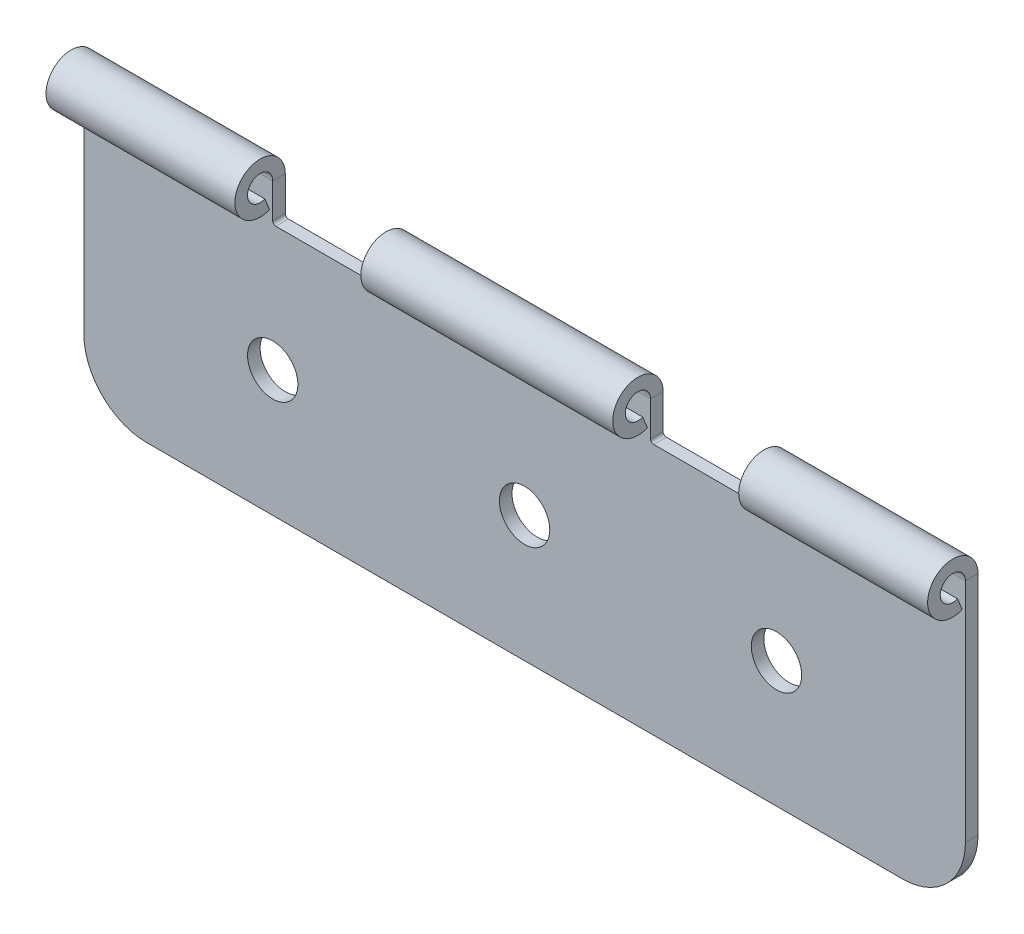
ISO-10303-21;
HEADER;
FILE_DESCRIPTION(('STEP AP214'),'2;1');
FILE_NAME('part.step','',(''),(''),'','','');
FILE_SCHEMA(('AUTOMOTIVE_DESIGN { 1 0 10303 214 1 1 1 1 }'));
ENDSEC;
DATA;
#1=APPLICATION_CONTEXT('core data for automotive mechanical design processes');
#2=APPLICATION_PROTOCOL_DEFINITION('international standard','automotive_design',2000,#1);
#3=PRODUCT_CONTEXT('',#1,'mechanical');
#4=PRODUCT('Part','Part','',(#3));
#5=PRODUCT_RELATED_PRODUCT_CATEGORY('part','',(#4));
#6=PRODUCT_DEFINITION_FORMATION('','',#4);
#7=PRODUCT_DEFINITION_CONTEXT('part definition',#1,'design');
#8=PRODUCT_DEFINITION('design','',#6,#7);
#9=PRODUCT_DEFINITION_SHAPE('','',#8);
#10=(LENGTH_UNIT() NAMED_UNIT(*) SI_UNIT(.MILLI.,.METRE.));
#11=(NAMED_UNIT(*) PLANE_ANGLE_UNIT() SI_UNIT($,.RADIAN.));
#12=(NAMED_UNIT(*) SI_UNIT($,.STERADIAN.) SOLID_ANGLE_UNIT());
#13=UNCERTAINTY_MEASURE_WITH_UNIT(LENGTH_MEASURE(1.E-05),#10,'distance_accuracy_value','');
#14=(GEOMETRIC_REPRESENTATION_CONTEXT(3) GLOBAL_UNCERTAINTY_ASSIGNED_CONTEXT((#13)) GLOBAL_UNIT_ASSIGNED_CONTEXT((#10,
#11,#12)) REPRESENTATION_CONTEXT('',''));
#15=CARTESIAN_POINT('',(0.,0.,0.));
#16=DIRECTION('',(0.,0.,1.));
#17=DIRECTION('',(1.,0.,0.));
#18=AXIS2_PLACEMENT_3D('',#15,#16,#17);
#19=CARTESIAN_POINT('',(135.,45.4282115593304,-4.44706117189366));
#20=DIRECTION('',(-1.,0.,0.));
#21=DIRECTION('',(0.,0.,1.));
#22=AXIS2_PLACEMENT_3D('',#19,#20,#21);
#23=PLANE('',#22);
#24=DIRECTION('',(0.,-1.,0.));
#25=VECTOR('',#24,1.);
#26=CARTESIAN_POINT('',(135.,45.4282115593304,-4.44706117189366));
#27=LINE('',#26,#25);
#28=CARTESIAN_POINT('',(135.,60.4282115593304,-4.44706117189367));
#29=VERTEX_POINT('',#28);
#30=CARTESIAN_POINT('',(135.,46.6782115593304,-4.44706117189366));
#31=VERTEX_POINT('',#30);
#32=EDGE_CURVE('E212',#29,#31,#27,.T.);
#33=ORIENTED_EDGE('',*,*,#32,.T.);
#34=DIRECTION('',(0.,0.,1.));
#35=VECTOR('',#34,1.);
#36=CARTESIAN_POINT('',(135.,46.6782115593304,0.552938828106335));
#37=LINE('',#36,#35);
#38=CARTESIAN_POINT('',(135.,46.6782115593304,0.552938828106335));
#39=VERTEX_POINT('',#38);
#40=EDGE_CURVE('E347',#31,#39,#37,.T.);
#41=ORIENTED_EDGE('',*,*,#40,.T.);
#42=DIRECTION('',(0.,-1.,0.));
#43=VECTOR('',#42,1.);
#44=CARTESIAN_POINT('',(135.,45.4282115593304,0.552938828106335));
#45=LINE('',#44,#43);
#46=CARTESIAN_POINT('',(135.,60.4282115593304,0.552938828106335));
#47=VERTEX_POINT('',#46);
#48=EDGE_CURVE('E352',#47,#39,#45,.T.);
#49=ORIENTED_EDGE('',*,*,#48,.F.);
#50=DIRECTION('',(0.,0.,-1.));
#51=VECTOR('',#50,1.);
#52=CARTESIAN_POINT('',(135.,60.4282115593304,0.552938828106327));
#53=LINE('',#52,#51);
#54=EDGE_CURVE('E224',#47,#29,#53,.T.);
#55=ORIENTED_EDGE('',*,*,#54,.T.);
#56=EDGE_LOOP('',(#33,#41,#49,#55));
#57=FACE_BOUND('',#56,.T.);
#58=ADVANCED_FACE('F44',(#57),#23,.T.);
#59=CARTESIAN_POINT('',(-15.,45.4282115593304,-4.44706117189366));
#60=DIRECTION('',(-1.,0.,0.));
#61=DIRECTION('',(0.,0.,1.));
#62=AXIS2_PLACEMENT_3D('',#59,#60,#61);
#63=PLANE('',#62);
#64=DIRECTION('',(0.,-1.,0.));
#65=VECTOR('',#64,1.);
#66=CARTESIAN_POINT('',(-15.,45.4282115593304,-4.44706117189366));
#67=LINE('',#66,#65);
#68=CARTESIAN_POINT('',(-15.,60.4282115593304,-4.44706117189368));
#69=VERTEX_POINT('',#68);
#70=CARTESIAN_POINT('',(-15.,46.6782115593304,-4.44706117189366));
#71=VERTEX_POINT('',#70);
#72=EDGE_CURVE('E337',#69,#71,#67,.T.);
#73=ORIENTED_EDGE('',*,*,#72,.T.);
#74=DIRECTION('',(0.,0.,1.));
#75=VECTOR('',#74,1.);
#76=CARTESIAN_POINT('',(-15.,46.6782115593304,0.552938828106335));
#77=LINE('',#76,#75);
#78=CARTESIAN_POINT('',(-15.,46.6782115593304,0.552938828106335));
#79=VERTEX_POINT('',#78);
#80=EDGE_CURVE('E379',#71,#79,#77,.T.);
#81=ORIENTED_EDGE('',*,*,#80,.T.);
#82=DIRECTION('',(0.,-1.,0.));
#83=VECTOR('',#82,1.);
#84=CARTESIAN_POINT('',(-15.,45.4282115593304,0.552938828106335));
#85=LINE('',#84,#83);
#86=CARTESIAN_POINT('',(-15.,60.4282115593304,0.552938828106335));
#87=VERTEX_POINT('',#86);
#88=EDGE_CURVE('E360',#87,#79,#85,.T.);
#89=ORIENTED_EDGE('',*,*,#88,.F.);
#90=DIRECTION('',(0.,0.,-1.));
#91=VECTOR('',#90,1.);
#92=CARTESIAN_POINT('',(-15.,60.4282115593304,0.552938828106324));
#93=LINE('',#92,#91);
#94=EDGE_CURVE('E269',#87,#69,#93,.T.);
#95=ORIENTED_EDGE('',*,*,#94,.T.);
#96=EDGE_LOOP('',(#73,#81,#89,#95));
#97=FACE_BOUND('',#96,.T.);
#98=ADVANCED_FACE('F462',(#97),#63,.T.);
#99=CARTESIAN_POINT('',(-140.,-54.5717884406696,-4.44706117189366));
#100=DIRECTION('',(-1.,0.,0.));
#101=DIRECTION('',(0.,0.,1.));
#102=AXIS2_PLACEMENT_3D('',#99,#100,#101);
#103=PLANE('',#102);
#104=DIRECTION('',(0.,-1.,0.));
#105=VECTOR('',#104,1.);
#106=CARTESIAN_POINT('',(-140.,-54.5717884406696,-4.44706117189366));
#107=LINE('',#106,#105);
#108=CARTESIAN_POINT('',(-140.,60.4282115593304,-4.44706117189367));
#109=VERTEX_POINT('',#108);
#110=CARTESIAN_POINT('',(-140.,-29.5717884406696,-4.44706117189366));
#111=VERTEX_POINT('',#110);
#112=EDGE_CURVE('E345',#109,#111,#107,.T.);
#113=ORIENTED_EDGE('',*,*,#112,.T.);
#114=DIRECTION('',(0.,0.,1.));
#115=VECTOR('',#114,1.);
#116=CARTESIAN_POINT('',(-140.,-29.5717884406696,-4.44706117189366));
#117=LINE('',#116,#115);
#118=CARTESIAN_POINT('',(-140.,-29.5717884406696,0.552938828106335));
#119=VERTEX_POINT('',#118);
#120=EDGE_CURVE('E11',#111,#119,#117,.T.);
#121=ORIENTED_EDGE('',*,*,#120,.T.);
#122=DIRECTION('',(0.,-1.,0.));
#123=VECTOR('',#122,1.);
#124=CARTESIAN_POINT('',(-140.,-54.5717884406696,0.552938828106335));
#125=LINE('',#124,#123);
#126=CARTESIAN_POINT('',(-140.,60.4282115593304,0.552938828106335));
#127=VERTEX_POINT('',#126);
#128=EDGE_CURVE('E329',#127,#119,#125,.T.);
#129=ORIENTED_EDGE('',*,*,#128,.F.);
#130=DIRECTION('',(0.,0.,-1.));
#131=VECTOR('',#130,1.);
#132=CARTESIAN_POINT('',(-140.,60.4282115593304,0.552938828106327));
#133=LINE('',#132,#131);
#134=EDGE_CURVE('E302',#127,#109,#133,.T.);
#135=ORIENTED_EDGE('',*,*,#134,.T.);
#136=EDGE_LOOP('',(#113,#121,#129,#135));
#137=FACE_BOUND('',#136,.T.);
#138=ADVANCED_FACE('F429',(#137),#103,.T.);
#139=CARTESIAN_POINT('',(210.,-54.5717884406696,-4.44706117189366));
#140=DIRECTION('',(0.,-1.,0.));
#141=DIRECTION('',(1.,0.,0.));
#142=AXIS2_PLACEMENT_3D('',#139,#140,#141);
#143=PLANE('',#142);
#144=DIRECTION('',(1.,0.,0.));
#145=VECTOR('',#144,1.);
#146=CARTESIAN_POINT('',(210.,-54.5717884406696,-4.44706117189366));
#147=LINE('',#146,#145);
#148=CARTESIAN_POINT('',(-115.,-54.5717884406696,-4.44706117189366));
#149=VERTEX_POINT('',#148);
#150=CARTESIAN_POINT('',(185.,-54.5717884406696,-4.44706117189366));
#151=VERTEX_POINT('',#150);
#152=EDGE_CURVE('E213',#149,#151,#147,.T.);
#153=ORIENTED_EDGE('',*,*,#152,.T.);
#154=DIRECTION('',(0.,0.,1.));
#155=VECTOR('',#154,1.);
#156=CARTESIAN_POINT('',(185.,-54.5717884406696,-4.44706117189366));
#157=LINE('',#156,#155);
#158=CARTESIAN_POINT('',(185.,-54.5717884406696,0.552938828106335));
#159=VERTEX_POINT('',#158);
#160=EDGE_CURVE('E407',#151,#159,#157,.T.);
#161=ORIENTED_EDGE('',*,*,#160,.T.);
#162=DIRECTION('',(1.,0.,0.));
#163=VECTOR('',#162,1.);
#164=CARTESIAN_POINT('',(210.,-54.5717884406696,0.552938828106335));
#165=LINE('',#164,#163);
#166=CARTESIAN_POINT('',(-115.,-54.5717884406696,0.552938828106335));
#167=VERTEX_POINT('',#166);
#168=EDGE_CURVE('E325',#167,#159,#165,.T.);
#169=ORIENTED_EDGE('',*,*,#168,.F.);
#170=DIRECTION('',(0.,0.,1.));
#171=VECTOR('',#170,1.);
#172=CARTESIAN_POINT('',(-115.,-54.5717884406696,-4.44706117189366));
#173=LINE('',#172,#171);
#174=EDGE_CURVE('E405',#167,#149,#173,.F.);
#175=ORIENTED_EDGE('',*,*,#174,.T.);
#176=EDGE_LOOP('',(#153,#161,#169,#175));
#177=FACE_BOUND('',#176,.T.);
#178=ADVANCED_FACE('F418',(#177),#143,.T.);
#179=CARTESIAN_POINT('',(-65.,70.4282115593304,-4.44706117189366));
#180=DIRECTION('',(1.,0.,0.));
#181=DIRECTION('',(0.,0.,-1.));
#182=AXIS2_PLACEMENT_3D('',#179,#180,#181);
#183=PLANE('',#182);
#184=DIRECTION('',(0.,1.,0.));
#185=VECTOR('',#184,1.);
#186=CARTESIAN_POINT('',(-65.,70.4282115593304,0.552938828106335));
#187=LINE('',#186,#185);
#188=CARTESIAN_POINT('',(-65.,46.6782115593304,0.552938828106335));
#189=VERTEX_POINT('',#188);
#190=CARTESIAN_POINT('',(-65.,60.4282115593304,0.552938828106334));
#191=VERTEX_POINT('',#190);
#192=EDGE_CURVE('E366',#189,#191,#187,.T.);
#193=ORIENTED_EDGE('',*,*,#192,.F.);
#194=DIRECTION('',(0.,0.,1.));
#195=VECTOR('',#194,1.);
#196=CARTESIAN_POINT('',(-65.,46.6782115593304,-4.44706117189366));
#197=LINE('',#196,#195);
#198=CARTESIAN_POINT('',(-65.,46.6782115593304,-4.44706117189366));
#199=VERTEX_POINT('',#198);
#200=EDGE_CURVE('E387',#189,#199,#197,.F.);
#201=ORIENTED_EDGE('',*,*,#200,.T.);
#202=DIRECTION('',(0.,1.,0.));
#203=VECTOR('',#202,1.);
#204=CARTESIAN_POINT('',(-65.,70.4282115593304,-4.44706117189366));
#205=LINE('',#204,#203);
#206=CARTESIAN_POINT('',(-65.,60.4282115593304,-4.44706117189367));
#207=VERTEX_POINT('',#206);
#208=EDGE_CURVE('E343',#199,#207,#205,.T.);
#209=ORIENTED_EDGE('',*,*,#208,.T.);
#210=DIRECTION('',(0.,0.,-1.));
#211=VECTOR('',#210,1.);
#212=CARTESIAN_POINT('',(-65.,60.4282115593304,0.552938828106334));
#213=LINE('',#212,#211);
#214=EDGE_CURVE('E318',#191,#207,#213,.T.);
#215=ORIENTED_EDGE('',*,*,#214,.F.);
#216=EDGE_LOOP('',(#193,#201,#209,#215));
#217=FACE_BOUND('',#216,.T.);
#218=ADVANCED_FACE('F443',(#217),#183,.T.);
#219=CARTESIAN_POINT('',(-65.,45.4282115593304,-4.44706117189366));
#220=DIRECTION('',(0.,1.,0.));
#221=DIRECTION('',(0.,0.,1.));
#222=AXIS2_PLACEMENT_3D('',#219,#220,#221);
#223=PLANE('',#222);
#224=DIRECTION('',(-1.,0.,0.));
#225=VECTOR('',#224,1.);
#226=CARTESIAN_POINT('',(-65.,45.4282115593304,0.552938828106335));
#227=LINE('',#226,#225);
#228=CARTESIAN_POINT('',(-16.25,45.4282115593304,0.552938828106335));
#229=VERTEX_POINT('',#228);
#230=CARTESIAN_POINT('',(-63.75,45.4282115593304,0.552938828106335));
#231=VERTEX_POINT('',#230);
#232=EDGE_CURVE('E363',#229,#231,#227,.T.);
#233=ORIENTED_EDGE('',*,*,#232,.F.);
#234=DIRECTION('',(0.,0.,1.));
#235=VECTOR('',#234,1.);
#236=CARTESIAN_POINT('',(-16.25,45.4282115593304,-4.44706117189366));
#237=LINE('',#236,#235);
#238=CARTESIAN_POINT('',(-16.25,45.4282115593304,-4.44706117189366));
#239=VERTEX_POINT('',#238);
#240=EDGE_CURVE('E385',#229,#239,#237,.F.);
#241=ORIENTED_EDGE('',*,*,#240,.T.);
#242=DIRECTION('',(-1.,0.,0.));
#243=VECTOR('',#242,1.);
#244=CARTESIAN_POINT('',(-65.,45.4282115593304,-4.44706117189366));
#245=LINE('',#244,#243);
#246=CARTESIAN_POINT('',(-63.75,45.4282115593304,-4.44706117189366));
#247=VERTEX_POINT('',#246);
#248=EDGE_CURVE('E340',#239,#247,#245,.T.);
#249=ORIENTED_EDGE('',*,*,#248,.T.);
#250=DIRECTION('',(0.,0.,1.));
#251=VECTOR('',#250,1.);
#252=CARTESIAN_POINT('',(-63.75,45.4282115593304,0.552938828106335));
#253=LINE('',#252,#251);
#254=EDGE_CURVE('E382',#247,#231,#253,.T.);
#255=ORIENTED_EDGE('',*,*,#254,.T.);
#256=EDGE_LOOP('',(#233,#241,#249,#255));
#257=FACE_BOUND('',#256,.T.);
#258=ADVANCED_FACE('F453',(#257),#223,.T.);
#259=CARTESIAN_POINT('',(85.,70.4282115593304,-4.44706117189366));
#260=DIRECTION('',(1.,0.,0.));
#261=DIRECTION('',(0.,0.,-1.));
#262=AXIS2_PLACEMENT_3D('',#259,#260,#261);
#263=PLANE('',#262);
#264=DIRECTION('',(0.,1.,0.));
#265=VECTOR('',#264,1.);
#266=CARTESIAN_POINT('',(85.,70.4282115593304,0.552938828106335));
#267=LINE('',#266,#265);
#268=CARTESIAN_POINT('',(85.,46.6782115593304,0.552938828106335));
#269=VERTEX_POINT('',#268);
#270=CARTESIAN_POINT('',(85.,60.4282115593304,0.552938828106335));
#271=VERTEX_POINT('',#270);
#272=EDGE_CURVE('E358',#269,#271,#267,.T.);
#273=ORIENTED_EDGE('',*,*,#272,.F.);
#274=DIRECTION('',(0.,0.,1.));
#275=VECTOR('',#274,1.);
#276=CARTESIAN_POINT('',(85.,46.6782115593304,-4.44706117189366));
#277=LINE('',#276,#275);
#278=CARTESIAN_POINT('',(85.,46.6782115593304,-4.44706117189366));
#279=VERTEX_POINT('',#278);
#280=EDGE_CURVE('E377',#269,#279,#277,.F.);
#281=ORIENTED_EDGE('',*,*,#280,.T.);
#282=DIRECTION('',(0.,1.,0.));
#283=VECTOR('',#282,1.);
#284=CARTESIAN_POINT('',(85.,70.4282115593304,-4.44706117189366));
#285=LINE('',#284,#283);
#286=CARTESIAN_POINT('',(85.,60.4282115593304,-4.44706117189366));
#287=VERTEX_POINT('',#286);
#288=EDGE_CURVE('E335',#279,#287,#285,.T.);
#289=ORIENTED_EDGE('',*,*,#288,.T.);
#290=DIRECTION('',(0.,0.,-1.));
#291=VECTOR('',#290,1.);
#292=CARTESIAN_POINT('',(85.,60.4282115593304,0.552938828106335));
#293=LINE('',#292,#291);
#294=EDGE_CURVE('E285',#271,#287,#293,.T.);
#295=ORIENTED_EDGE('',*,*,#294,.F.);
#296=EDGE_LOOP('',(#273,#281,#289,#295));
#297=FACE_BOUND('',#296,.T.);
#298=ADVANCED_FACE('F486',(#297),#263,.T.);
#299=CARTESIAN_POINT('',(85.,45.4282115593304,-4.44706117189366));
#300=DIRECTION('',(0.,1.,0.));
#301=DIRECTION('',(0.,0.,1.));
#302=AXIS2_PLACEMENT_3D('',#299,#300,#301);
#303=PLANE('',#302);
#304=DIRECTION('',(-1.,0.,0.));
#305=VECTOR('',#304,1.);
#306=CARTESIAN_POINT('',(85.,45.4282115593304,0.552938828106335));
#307=LINE('',#306,#305);
#308=CARTESIAN_POINT('',(133.75,45.4282115593304,0.552938828106335));
#309=VERTEX_POINT('',#308);
#310=CARTESIAN_POINT('',(86.25,45.4282115593304,0.552938828106335));
#311=VERTEX_POINT('',#310);
#312=EDGE_CURVE('E355',#309,#311,#307,.T.);
#313=ORIENTED_EDGE('',*,*,#312,.F.);
#314=DIRECTION('',(0.,0.,1.));
#315=VECTOR('',#314,1.);
#316=CARTESIAN_POINT('',(133.75,45.4282115593304,-4.44706117189366));
#317=LINE('',#316,#315);
#318=CARTESIAN_POINT('',(133.75,45.4282115593304,-4.44706117189366));
#319=VERTEX_POINT('',#318);
#320=EDGE_CURVE('E375',#309,#319,#317,.F.);
#321=ORIENTED_EDGE('',*,*,#320,.T.);
#322=DIRECTION('',(-1.,0.,0.));
#323=VECTOR('',#322,1.);
#324=CARTESIAN_POINT('',(85.,45.4282115593304,-4.44706117189366));
#325=LINE('',#324,#323);
#326=CARTESIAN_POINT('',(86.25,45.4282115593304,-4.44706117189366));
#327=VERTEX_POINT('',#326);
#328=EDGE_CURVE('E332',#319,#327,#325,.T.);
#329=ORIENTED_EDGE('',*,*,#328,.T.);
#330=DIRECTION('',(0.,0.,1.));
#331=VECTOR('',#330,1.);
#332=CARTESIAN_POINT('',(86.25,45.4282115593304,0.552938828106335));
#333=LINE('',#332,#331);
#334=EDGE_CURVE('E372',#327,#311,#333,.T.);
#335=ORIENTED_EDGE('',*,*,#334,.T.);
#336=EDGE_LOOP('',(#313,#321,#329,#335));
#337=FACE_BOUND('',#336,.T.);
#338=ADVANCED_FACE('F495',(#337),#303,.T.);
#339=CARTESIAN_POINT('',(210.,70.4282115593304,-4.44706117189366));
#340=DIRECTION('',(1.,0.,0.));
#341=DIRECTION('',(0.,0.,-1.));
#342=AXIS2_PLACEMENT_3D('',#339,#340,#341);
#343=PLANE('',#342);
#344=DIRECTION('',(0.,1.,0.));
#345=VECTOR('',#344,1.);
#346=CARTESIAN_POINT('',(210.,70.4282115593304,0.552938828106335));
#347=LINE('',#346,#345);
#348=CARTESIAN_POINT('',(210.,-29.5717884406696,0.552938828106335));
#349=VERTEX_POINT('',#348);
#350=CARTESIAN_POINT('',(210.,60.4282115593304,0.552938828106334));
#351=VERTEX_POINT('',#350);
#352=EDGE_CURVE('E350',#349,#351,#347,.T.);
#353=ORIENTED_EDGE('',*,*,#352,.F.);
#354=DIRECTION('',(0.,0.,1.));
#355=VECTOR('',#354,1.);
#356=CARTESIAN_POINT('',(210.,-29.5717884406696,-4.44706117189366));
#357=LINE('',#356,#355);
#358=CARTESIAN_POINT('',(210.,-29.5717884406696,-4.44706117189366));
#359=VERTEX_POINT('',#358);
#360=EDGE_CURVE('E67',#349,#359,#357,.F.);
#361=ORIENTED_EDGE('',*,*,#360,.T.);
#362=DIRECTION('',(0.,1.,0.));
#363=VECTOR('',#362,1.);
#364=CARTESIAN_POINT('',(210.,70.4282115593304,-4.44706117189366));
#365=LINE('',#364,#363);
#366=CARTESIAN_POINT('',(210.,60.4282115593304,-4.44706117189367));
#367=VERTEX_POINT('',#366);
#368=EDGE_CURVE('E206',#359,#367,#365,.T.);
#369=ORIENTED_EDGE('',*,*,#368,.T.);
#370=DIRECTION('',(0.,0.,-1.));
#371=VECTOR('',#370,1.);
#372=CARTESIAN_POINT('',(210.,60.4282115593304,0.552938828106334));
#373=LINE('',#372,#371);
#374=EDGE_CURVE('E209',#351,#367,#373,.T.);
#375=ORIENTED_EDGE('',*,*,#374,.F.);
#376=EDGE_LOOP('',(#353,#361,#369,#375));
#377=FACE_BOUND('',#376,.T.);
#378=ADVANCED_FACE('F208',(#377),#343,.T.);
#379=CARTESIAN_POINT('',(-140.,-54.5717884406696,-4.44706117189366));
#380=DIRECTION('',(0.,0.,-1.));
#381=DIRECTION('',(-1.,0.,0.));
#382=AXIS2_PLACEMENT_3D('',#379,#380,#381);
#383=PLANE('',#382);
#384=CARTESIAN_POINT('',(135.,-4.57178844066959,-4.44706117189368));
#385=DIRECTION('',(0.,0.,1.));
#386=DIRECTION('',(1.,0.,0.));
#387=AXIS2_PLACEMENT_3D('',#384,#385,#386);
#388=CIRCLE('',#387,10.);
#389=CARTESIAN_POINT('',(145.,-4.57178844066959,-4.44706117189368));
#390=VERTEX_POINT('',#389);
#391=EDGE_CURVE('E942',#390,#390,#388,.T.);
#392=ORIENTED_EDGE('',*,*,#391,.T.);
#393=EDGE_LOOP('',(#392));
#394=FACE_BOUND('',#393,.T.);
#395=CARTESIAN_POINT('',(-65.,-4.57178844066959,-4.44706117189368));
#396=DIRECTION('',(0.,0.,1.));
#397=DIRECTION('',(1.,0.,0.));
#398=AXIS2_PLACEMENT_3D('',#395,#396,#397);
#399=CIRCLE('',#398,10.);
#400=CARTESIAN_POINT('',(-55.,-4.57178844066959,-4.44706117189368));
#401=VERTEX_POINT('',#400);
#402=EDGE_CURVE('E946',#401,#401,#399,.T.);
#403=ORIENTED_EDGE('',*,*,#402,.T.);
#404=EDGE_LOOP('',(#403));
#405=FACE_BOUND('',#404,.T.);
#406=CARTESIAN_POINT('',(35.,-4.57178844066959,-4.44706117189368));
#407=DIRECTION('',(0.,0.,1.));
#408=DIRECTION('',(1.,0.,0.));
#409=AXIS2_PLACEMENT_3D('',#406,#407,#408);
#410=CIRCLE('',#409,10.);
#411=CARTESIAN_POINT('',(45.,-4.57178844066959,-4.44706117189368));
#412=VERTEX_POINT('',#411);
#413=EDGE_CURVE('E254',#412,#412,#410,.T.);
#414=ORIENTED_EDGE('',*,*,#413,.T.);
#415=EDGE_LOOP('',(#414));
#416=FACE_BOUND('',#415,.T.);
#417=ORIENTED_EDGE('',*,*,#368,.F.);
#418=CARTESIAN_POINT('',(185.,-29.5717884406696,-4.44706117189366));
#419=DIRECTION('',(0.,0.,-1.));
#420=DIRECTION('',(-1.,0.,0.));
#421=AXIS2_PLACEMENT_3D('',#418,#419,#420);
#422=CIRCLE('',#421,25.);
#423=EDGE_CURVE('E52',#359,#151,#422,.T.);
#424=ORIENTED_EDGE('',*,*,#423,.T.);
#425=ORIENTED_EDGE('',*,*,#152,.F.);
#426=CARTESIAN_POINT('',(-115.,-29.5717884406696,-4.44706117189366));
#427=DIRECTION('',(0.,0.,-1.));
#428=DIRECTION('',(-1.,0.,0.));
#429=AXIS2_PLACEMENT_3D('',#426,#427,#428);
#430=CIRCLE('',#429,25.);
#431=EDGE_CURVE('E59',#149,#111,#430,.T.);
#432=ORIENTED_EDGE('',*,*,#431,.T.);
#433=ORIENTED_EDGE('',*,*,#112,.F.);
#434=DIRECTION('',(-1.,0.,0.));
#435=VECTOR('',#434,1.);
#436=CARTESIAN_POINT('',(-140.,60.4282115593304,-4.44706117189367));
#437=LINE('',#436,#435);
#438=EDGE_CURVE('E295',#109,#207,#437,.F.);
#439=ORIENTED_EDGE('',*,*,#438,.T.);
#440=ORIENTED_EDGE('',*,*,#208,.F.);
#441=CARTESIAN_POINT('',(-63.75,46.6782115593304,-4.44706117189366));
#442=DIRECTION('',(0.,0.,-1.));
#443=DIRECTION('',(-1.,0.,0.));
#444=AXIS2_PLACEMENT_3D('',#441,#442,#443);
#445=CIRCLE('',#444,1.25);
#446=EDGE_CURVE('E403',#199,#247,#445,.F.);
#447=ORIENTED_EDGE('',*,*,#446,.T.);
#448=ORIENTED_EDGE('',*,*,#248,.F.);
#449=CARTESIAN_POINT('',(-16.25,46.6782115593304,-4.44706117189366));
#450=DIRECTION('',(0.,0.,-1.));
#451=DIRECTION('',(-1.,0.,0.));
#452=AXIS2_PLACEMENT_3D('',#449,#450,#451);
#453=CIRCLE('',#452,1.25);
#454=EDGE_CURVE('E399',#239,#71,#453,.F.);
#455=ORIENTED_EDGE('',*,*,#454,.T.);
#456=ORIENTED_EDGE('',*,*,#72,.F.);
#457=DIRECTION('',(-1.,0.,0.));
#458=VECTOR('',#457,1.);
#459=CARTESIAN_POINT('',(-15.,60.4282115593304,-4.44706117189368));
#460=LINE('',#459,#458);
#461=EDGE_CURVE('E262',#69,#287,#460,.F.);
#462=ORIENTED_EDGE('',*,*,#461,.T.);
#463=ORIENTED_EDGE('',*,*,#288,.F.);
#464=CARTESIAN_POINT('',(86.25,46.6782115593304,-4.44706117189366));
#465=DIRECTION('',(0.,0.,-1.));
#466=DIRECTION('',(-1.,0.,0.));
#467=AXIS2_PLACEMENT_3D('',#464,#465,#466);
#468=CIRCLE('',#467,1.25);
#469=EDGE_CURVE('E395',#279,#327,#468,.F.);
#470=ORIENTED_EDGE('',*,*,#469,.T.);
#471=ORIENTED_EDGE('',*,*,#328,.F.);
#472=CARTESIAN_POINT('',(133.75,46.6782115593304,-4.44706117189366));
#473=DIRECTION('',(0.,0.,-1.));
#474=DIRECTION('',(-1.,0.,0.));
#475=AXIS2_PLACEMENT_3D('',#472,#473,#474);
#476=CIRCLE('',#475,1.25);
#477=EDGE_CURVE('E391',#319,#31,#476,.F.);
#478=ORIENTED_EDGE('',*,*,#477,.T.);
#479=ORIENTED_EDGE('',*,*,#32,.F.);
#480=DIRECTION('',(-1.,0.,0.));
#481=VECTOR('',#480,1.);
#482=CARTESIAN_POINT('',(135.,60.4282115593304,-4.44706117189367));
#483=LINE('',#482,#481);
#484=EDGE_CURVE('E230',#29,#367,#483,.F.);
#485=ORIENTED_EDGE('',*,*,#484,.T.);
#486=EDGE_LOOP('',(#417,#424,#425,#432,#433,#439,#440,#447,#448,#455,#456,#462,#463,#470,#471,
#478,#479,#485));
#487=FACE_BOUND('',#486,.T.);
#488=ADVANCED_FACE('F236',(#394,#405,#416,#487),#383,.T.);
#489=CARTESIAN_POINT('',(-140.,-54.5717884406696,0.552938828106335));
#490=DIRECTION('',(0.,0.,-1.));
#491=DIRECTION('',(-1.,0.,0.));
#492=AXIS2_PLACEMENT_3D('',#489,#490,#491);
#493=PLANE('',#492);
#494=CARTESIAN_POINT('',(135.,-4.57178844066959,0.552938828106335));
#495=DIRECTION('',(0.,0.,1.));
#496=DIRECTION('',(1.,0.,0.));
#497=AXIS2_PLACEMENT_3D('',#494,#495,#496);
#498=CIRCLE('',#497,10.);
#499=CARTESIAN_POINT('',(145.,-4.57178844066959,0.552938828106335));
#500=VERTEX_POINT('',#499);
#501=EDGE_CURVE('E955',#500,#500,#498,.T.);
#502=ORIENTED_EDGE('',*,*,#501,.F.);
#503=EDGE_LOOP('',(#502));
#504=FACE_BOUND('',#503,.T.);
#505=CARTESIAN_POINT('',(-65.,-4.57178844066959,0.552938828106335));
#506=DIRECTION('',(0.,0.,1.));
#507=DIRECTION('',(1.,0.,0.));
#508=AXIS2_PLACEMENT_3D('',#505,#506,#507);
#509=CIRCLE('',#508,10.);
#510=CARTESIAN_POINT('',(-55.,-4.57178844066959,0.552938828106335));
#511=VERTEX_POINT('',#510);
#512=EDGE_CURVE('E951',#511,#511,#509,.T.);
#513=ORIENTED_EDGE('',*,*,#512,.F.);
#514=EDGE_LOOP('',(#513));
#515=FACE_BOUND('',#514,.T.);
#516=CARTESIAN_POINT('',(35.,-4.57178844066959,0.552938828106335));
#517=DIRECTION('',(0.,0.,1.));
#518=DIRECTION('',(1.,0.,0.));
#519=AXIS2_PLACEMENT_3D('',#516,#517,#518);
#520=CIRCLE('',#519,10.);
#521=CARTESIAN_POINT('',(45.,-4.57178844066959,0.552938828106335));
#522=VERTEX_POINT('',#521);
#523=EDGE_CURVE('E242',#522,#522,#520,.T.);
#524=ORIENTED_EDGE('',*,*,#523,.F.);
#525=EDGE_LOOP('',(#524));
#526=FACE_BOUND('',#525,.T.);
#527=ORIENTED_EDGE('',*,*,#168,.T.);
#528=CARTESIAN_POINT('',(185.,-29.5717884406696,0.552938828106335));
#529=DIRECTION('',(0.,0.,-1.));
#530=DIRECTION('',(-1.,0.,0.));
#531=AXIS2_PLACEMENT_3D('',#528,#529,#530);
#532=CIRCLE('',#531,25.);
#533=EDGE_CURVE('E412',#159,#349,#532,.F.);
#534=ORIENTED_EDGE('',*,*,#533,.T.);
#535=ORIENTED_EDGE('',*,*,#352,.T.);
#536=DIRECTION('',(-1.,0.,0.));
#537=VECTOR('',#536,1.);
#538=CARTESIAN_POINT('',(135.,60.4282115593304,0.552938828106327));
#539=LINE('',#538,#537);
#540=EDGE_CURVE('E247',#47,#351,#539,.F.);
#541=ORIENTED_EDGE('',*,*,#540,.F.);
#542=ORIENTED_EDGE('',*,*,#48,.T.);
#543=CARTESIAN_POINT('',(133.75,46.6782115593304,0.552938828106335));
#544=DIRECTION('',(0.,0.,-1.));
#545=DIRECTION('',(-1.,0.,0.));
#546=AXIS2_PLACEMENT_3D('',#543,#544,#545);
#547=CIRCLE('',#546,1.25);
#548=EDGE_CURVE('E389',#39,#309,#547,.T.);
#549=ORIENTED_EDGE('',*,*,#548,.T.);
#550=ORIENTED_EDGE('',*,*,#312,.T.);
#551=CARTESIAN_POINT('',(86.25,46.6782115593304,0.552938828106335));
#552=DIRECTION('',(0.,0.,-1.));
#553=DIRECTION('',(-1.,0.,0.));
#554=AXIS2_PLACEMENT_3D('',#551,#552,#553);
#555=CIRCLE('',#554,1.25);
#556=EDGE_CURVE('E393',#311,#269,#555,.T.);
#557=ORIENTED_EDGE('',*,*,#556,.T.);
#558=ORIENTED_EDGE('',*,*,#272,.T.);
#559=DIRECTION('',(-1.,0.,0.));
#560=VECTOR('',#559,1.);
#561=CARTESIAN_POINT('',(-15.,60.4282115593304,0.552938828106324));
#562=LINE('',#561,#560);
#563=EDGE_CURVE('E278',#87,#271,#562,.F.);
#564=ORIENTED_EDGE('',*,*,#563,.F.);
#565=ORIENTED_EDGE('',*,*,#88,.T.);
#566=CARTESIAN_POINT('',(-16.25,46.6782115593304,0.552938828106335));
#567=DIRECTION('',(0.,0.,-1.));
#568=DIRECTION('',(-1.,0.,0.));
#569=AXIS2_PLACEMENT_3D('',#566,#567,#568);
#570=CIRCLE('',#569,1.25);
#571=EDGE_CURVE('E397',#79,#229,#570,.T.);
#572=ORIENTED_EDGE('',*,*,#571,.T.);
#573=ORIENTED_EDGE('',*,*,#232,.T.);
#574=CARTESIAN_POINT('',(-63.75,46.6782115593304,0.552938828106335));
#575=DIRECTION('',(0.,0.,-1.));
#576=DIRECTION('',(-1.,0.,0.));
#577=AXIS2_PLACEMENT_3D('',#574,#575,#576);
#578=CIRCLE('',#577,1.25);
#579=EDGE_CURVE('E401',#231,#189,#578,.T.);
#580=ORIENTED_EDGE('',*,*,#579,.T.);
#581=ORIENTED_EDGE('',*,*,#192,.T.);
#582=DIRECTION('',(-1.,0.,0.));
#583=VECTOR('',#582,1.);
#584=CARTESIAN_POINT('',(-140.,60.4282115593304,0.552938828106327));
#585=LINE('',#584,#583);
#586=EDGE_CURVE('E311',#127,#191,#585,.F.);
#587=ORIENTED_EDGE('',*,*,#586,.F.);
#588=ORIENTED_EDGE('',*,*,#128,.T.);
#589=CARTESIAN_POINT('',(-115.,-29.5717884406696,0.552938828106335));
#590=DIRECTION('',(0.,0.,-1.));
#591=DIRECTION('',(-1.,0.,0.));
#592=AXIS2_PLACEMENT_3D('',#589,#590,#591);
#593=CIRCLE('',#592,25.);
#594=EDGE_CURVE('E410',#119,#167,#593,.F.);
#595=ORIENTED_EDGE('',*,*,#594,.T.);
#596=EDGE_LOOP('',(#527,#534,#535,#541,#542,#549,#550,#557,#558,#564,#565,#572,#573,#580,#581,
#587,#588,#595));
#597=FACE_BOUND('',#596,.T.);
#598=ADVANCED_FACE('F423',(#504,#515,#526,#597),#493,.F.);
#599=CARTESIAN_POINT('',(-102.5,55.7922922864965,3.67990586102672));
#600=DIRECTION('',(0.,-0.374606593415923,0.927183854566783));
#601=DIRECTION('',(-1.,0.,0.));
#602=AXIS2_PLACEMENT_3D('',#599,#600,#601);
#603=PLANE('',#602);
#604=DIRECTION('',(0.,-0.927183854566783,-0.374606593415923));
#605=VECTOR('',#604,1.);
#606=CARTESIAN_POINT('',(-140.,55.7922922864965,3.67990586102671));
#607=LINE('',#606,#605);
#608=CARTESIAN_POINT('',(-140.,55.7922922864965,3.67990586102671));
#609=VERTEX_POINT('',#608);
#610=CARTESIAN_POINT('',(-140.,51.1563730136626,1.8068728939471));
#611=VERTEX_POINT('',#610);
#612=EDGE_CURVE('E323',#609,#611,#607,.T.);
#613=ORIENTED_EDGE('',*,*,#612,.F.);
#614=DIRECTION('',(-1.,0.,0.));
#615=VECTOR('',#614,1.);
#616=CARTESIAN_POINT('',(-140.,55.7922922864965,3.67990586102671));
#617=LINE('',#616,#615);
#618=CARTESIAN_POINT('',(-65.,55.7922922864965,3.67990586102672));
#619=VERTEX_POINT('',#618);
#620=EDGE_CURVE('E292',#619,#609,#617,.T.);
#621=ORIENTED_EDGE('',*,*,#620,.F.);
#622=DIRECTION('',(0.,-0.927183854566783,-0.374606593415923));
#623=VECTOR('',#622,1.);
#624=CARTESIAN_POINT('',(-65.,55.7922922864965,3.67990586102672));
#625=LINE('',#624,#623);
#626=CARTESIAN_POINT('',(-65.,51.1563730136626,1.80687289394711));
#627=VERTEX_POINT('',#626);
#628=EDGE_CURVE('E321',#619,#627,#625,.T.);
#629=ORIENTED_EDGE('',*,*,#628,.T.);
#630=DIRECTION('',(-1.,0.,0.));
#631=VECTOR('',#630,1.);
#632=CARTESIAN_POINT('',(-140.,51.1563730136626,1.8068728939471));
#633=LINE('',#632,#631);
#634=EDGE_CURVE('E303',#627,#611,#633,.T.);
#635=ORIENTED_EDGE('',*,*,#634,.T.);
#636=EDGE_LOOP('',(#613,#621,#629,#635));
#637=FACE_BOUND('',#636,.T.);
#638=ADVANCED_FACE('F734',(#637),#603,.F.);
#639=CARTESIAN_POINT('',(-65.,60.4282115593304,5.55293882810634));
#640=DIRECTION('',(1.,0.,0.));
#641=DIRECTION('',(0.,0.,-1.));
#642=AXIS2_PLACEMENT_3D('',#639,#640,#641);
#643=PLANE('',#642);
#644=ORIENTED_EDGE('',*,*,#628,.F.);
#645=CARTESIAN_POINT('',(-65.,60.4282115593304,5.55293882810634));
#646=DIRECTION('',(-1.,0.,0.));
#647=DIRECTION('',(0.,0.,1.));
#648=AXIS2_PLACEMENT_3D('',#645,#646,#647);
#649=CIRCLE('',#648,5.);
#650=EDGE_CURVE('E306',#191,#619,#649,.F.);
#651=ORIENTED_EDGE('',*,*,#650,.F.);
#652=ORIENTED_EDGE('',*,*,#214,.T.);
#653=CARTESIAN_POINT('',(-65.,60.4282115593304,5.55293882810634));
#654=DIRECTION('',(-1.,0.,0.));
#655=DIRECTION('',(0.,0.,1.));
#656=AXIS2_PLACEMENT_3D('',#653,#654,#655);
#657=CIRCLE('',#656,10.);
#658=EDGE_CURVE('E298',#207,#627,#657,.F.);
#659=ORIENTED_EDGE('',*,*,#658,.T.);
#660=EDGE_LOOP('',(#644,#651,#652,#659));
#661=FACE_BOUND('',#660,.T.);
#662=ADVANCED_FACE('F439',(#661),#643,.T.);
#663=CARTESIAN_POINT('',(-140.,60.4282115593304,5.55293882810633));
#664=DIRECTION('',(1.,0.,0.));
#665=DIRECTION('',(0.,0.,-1.));
#666=AXIS2_PLACEMENT_3D('',#663,#664,#665);
#667=PLANE('',#666);
#668=CARTESIAN_POINT('',(-140.,60.4282115593304,5.55293882810633));
#669=DIRECTION('',(-1.,0.,0.));
#670=DIRECTION('',(0.,0.,1.));
#671=AXIS2_PLACEMENT_3D('',#668,#669,#670);
#672=CIRCLE('',#671,5.);
#673=EDGE_CURVE('E314',#609,#127,#672,.T.);
#674=ORIENTED_EDGE('',*,*,#673,.F.);
#675=ORIENTED_EDGE('',*,*,#612,.T.);
#676=CARTESIAN_POINT('',(-140.,60.4282115593304,5.55293882810633));
#677=DIRECTION('',(-1.,0.,0.));
#678=DIRECTION('',(0.,0.,1.));
#679=AXIS2_PLACEMENT_3D('',#676,#677,#678);
#680=CIRCLE('',#679,10.);
#681=EDGE_CURVE('E299',#611,#109,#680,.T.);
#682=ORIENTED_EDGE('',*,*,#681,.T.);
#683=ORIENTED_EDGE('',*,*,#134,.F.);
#684=EDGE_LOOP('',(#674,#675,#682,#683));
#685=FACE_BOUND('',#684,.T.);
#686=ADVANCED_FACE('F713',(#685),#667,.F.);
#687=CARTESIAN_POINT('',(-140.,60.4282115593304,5.55293882810633));
#688=DIRECTION('',(-1.,0.,0.));
#689=DIRECTION('',(0.,-0.927183854566783,-0.374606593415923));
#690=AXIS2_PLACEMENT_3D('',#687,#688,#689);
#691=CYLINDRICAL_SURFACE('',#690,10.);
#692=ORIENTED_EDGE('',*,*,#438,.F.);
#693=ORIENTED_EDGE('',*,*,#681,.F.);
#694=ORIENTED_EDGE('',*,*,#634,.F.);
#695=ORIENTED_EDGE('',*,*,#658,.F.);
#696=EDGE_LOOP('',(#692,#693,#694,#695));
#697=FACE_BOUND('',#696,.T.);
#698=ADVANCED_FACE('F703',(#697),#691,.T.);
#699=CARTESIAN_POINT('',(-140.,60.4282115593304,5.55293882810633));
#700=DIRECTION('',(-1.,0.,0.));
#701=DIRECTION('',(0.,-0.927183854566783,-0.374606593415923));
#702=AXIS2_PLACEMENT_3D('',#699,#700,#701);
#703=CYLINDRICAL_SURFACE('',#702,5.);
#704=ORIENTED_EDGE('',*,*,#586,.T.);
#705=ORIENTED_EDGE('',*,*,#650,.T.);
#706=ORIENTED_EDGE('',*,*,#620,.T.);
#707=ORIENTED_EDGE('',*,*,#673,.T.);
#708=EDGE_LOOP('',(#704,#705,#706,#707));
#709=FACE_BOUND('',#708,.T.);
#710=ADVANCED_FACE('F434',(#709),#703,.F.);
#711=CARTESIAN_POINT('',(35.,55.7922922864965,3.67990586102672));
#712=DIRECTION('',(0.,-0.374606593415923,0.927183854566783));
#713=DIRECTION('',(-1.,0.,0.));
#714=AXIS2_PLACEMENT_3D('',#711,#712,#713);
#715=PLANE('',#714);
#716=DIRECTION('',(0.,-0.927183854566783,-0.374606593415923));
#717=VECTOR('',#716,1.);
#718=CARTESIAN_POINT('',(-15.,55.7922922864965,3.67990586102671));
#719=LINE('',#718,#717);
#720=CARTESIAN_POINT('',(-15.,55.7922922864965,3.67990586102671));
#721=VERTEX_POINT('',#720);
#722=CARTESIAN_POINT('',(-15.,51.1563730136626,1.8068728939471));
#723=VERTEX_POINT('',#722);
#724=EDGE_CURVE('E290',#721,#723,#719,.T.);
#725=ORIENTED_EDGE('',*,*,#724,.F.);
#726=DIRECTION('',(-1.,0.,0.));
#727=VECTOR('',#726,1.);
#728=CARTESIAN_POINT('',(-15.,55.7922922864965,3.67990586102671));
#729=LINE('',#728,#727);
#730=CARTESIAN_POINT('',(85.,55.7922922864965,3.67990586102672));
#731=VERTEX_POINT('',#730);
#732=EDGE_CURVE('E259',#731,#721,#729,.T.);
#733=ORIENTED_EDGE('',*,*,#732,.F.);
#734=DIRECTION('',(0.,-0.927183854566783,-0.374606593415923));
#735=VECTOR('',#734,1.);
#736=CARTESIAN_POINT('',(85.,55.7922922864965,3.67990586102672));
#737=LINE('',#736,#735);
#738=CARTESIAN_POINT('',(85.,51.1563730136626,1.80687289394711));
#739=VERTEX_POINT('',#738);
#740=EDGE_CURVE('E288',#731,#739,#737,.T.);
#741=ORIENTED_EDGE('',*,*,#740,.T.);
#742=DIRECTION('',(-1.,0.,0.));
#743=VECTOR('',#742,1.);
#744=CARTESIAN_POINT('',(-15.,51.1563730136626,1.8068728939471));
#745=LINE('',#744,#743);
#746=EDGE_CURVE('E270',#739,#723,#745,.T.);
#747=ORIENTED_EDGE('',*,*,#746,.T.);
#748=EDGE_LOOP('',(#725,#733,#741,#747));
#749=FACE_BOUND('',#748,.T.);
#750=ADVANCED_FACE('F477',(#749),#715,.F.);
#751=CARTESIAN_POINT('',(85.,60.4282115593304,5.55293882810634));
#752=DIRECTION('',(1.,0.,0.));
#753=DIRECTION('',(0.,0.,-1.));
#754=AXIS2_PLACEMENT_3D('',#751,#752,#753);
#755=PLANE('',#754);
#756=ORIENTED_EDGE('',*,*,#740,.F.);
#757=CARTESIAN_POINT('',(85.,60.4282115593304,5.55293882810634));
#758=DIRECTION('',(-1.,0.,0.));
#759=DIRECTION('',(0.,0.,1.));
#760=AXIS2_PLACEMENT_3D('',#757,#758,#759);
#761=CIRCLE('',#760,5.);
#762=EDGE_CURVE('E273',#271,#731,#761,.F.);
#763=ORIENTED_EDGE('',*,*,#762,.F.);
#764=ORIENTED_EDGE('',*,*,#294,.T.);
#765=CARTESIAN_POINT('',(85.,60.4282115593304,5.55293882810634));
#766=DIRECTION('',(-1.,0.,0.));
#767=DIRECTION('',(0.,0.,1.));
#768=AXIS2_PLACEMENT_3D('',#765,#766,#767);
#769=CIRCLE('',#768,10.);
#770=EDGE_CURVE('E265',#287,#739,#769,.F.);
#771=ORIENTED_EDGE('',*,*,#770,.T.);
#772=EDGE_LOOP('',(#756,#763,#764,#771));
#773=FACE_BOUND('',#772,.T.);
#774=ADVANCED_FACE('F483',(#773),#755,.T.);
#775=CARTESIAN_POINT('',(-15.,60.4282115593304,5.55293882810633));
#776=DIRECTION('',(1.,0.,0.));
#777=DIRECTION('',(0.,0.,-1.));
#778=AXIS2_PLACEMENT_3D('',#775,#776,#777);
#779=PLANE('',#778);
#780=CARTESIAN_POINT('',(-15.,60.4282115593304,5.55293882810633));
#781=DIRECTION('',(-1.,0.,0.));
#782=DIRECTION('',(0.,0.,1.));
#783=AXIS2_PLACEMENT_3D('',#780,#781,#782);
#784=CIRCLE('',#783,5.);
#785=EDGE_CURVE('E281',#721,#87,#784,.T.);
#786=ORIENTED_EDGE('',*,*,#785,.F.);
#787=ORIENTED_EDGE('',*,*,#724,.T.);
#788=CARTESIAN_POINT('',(-15.,60.4282115593304,5.55293882810633));
#789=DIRECTION('',(-1.,0.,0.));
#790=DIRECTION('',(0.,0.,1.));
#791=AXIS2_PLACEMENT_3D('',#788,#789,#790);
#792=CIRCLE('',#791,10.);
#793=EDGE_CURVE('E266',#723,#69,#792,.T.);
#794=ORIENTED_EDGE('',*,*,#793,.T.);
#795=ORIENTED_EDGE('',*,*,#94,.F.);
#796=EDGE_LOOP('',(#786,#787,#794,#795));
#797=FACE_BOUND('',#796,.T.);
#798=ADVANCED_FACE('F474',(#797),#779,.F.);
#799=CARTESIAN_POINT('',(-15.,60.4282115593304,5.55293882810633));
#800=DIRECTION('',(-1.,0.,0.));
#801=DIRECTION('',(0.,-0.927183854566783,-0.374606593415923));
#802=AXIS2_PLACEMENT_3D('',#799,#800,#801);
#803=CYLINDRICAL_SURFACE('',#802,10.);
#804=ORIENTED_EDGE('',*,*,#461,.F.);
#805=ORIENTED_EDGE('',*,*,#793,.F.);
#806=ORIENTED_EDGE('',*,*,#746,.F.);
#807=ORIENTED_EDGE('',*,*,#770,.F.);
#808=EDGE_LOOP('',(#804,#805,#806,#807));
#809=FACE_BOUND('',#808,.T.);
#810=ADVANCED_FACE('F470',(#809),#803,.T.);
#811=CARTESIAN_POINT('',(-15.,60.4282115593304,5.55293882810633));
#812=DIRECTION('',(-1.,0.,0.));
#813=DIRECTION('',(0.,-0.927183854566783,-0.374606593415923));
#814=AXIS2_PLACEMENT_3D('',#811,#812,#813);
#815=CYLINDRICAL_SURFACE('',#814,5.);
#816=ORIENTED_EDGE('',*,*,#563,.T.);
#817=ORIENTED_EDGE('',*,*,#762,.T.);
#818=ORIENTED_EDGE('',*,*,#732,.T.);
#819=ORIENTED_EDGE('',*,*,#785,.T.);
#820=EDGE_LOOP('',(#816,#817,#818,#819));
#821=FACE_BOUND('',#820,.T.);
#822=ADVANCED_FACE('F479',(#821),#815,.F.);
#823=CARTESIAN_POINT('',(172.5,55.7922922864965,3.67990586102672));
#824=DIRECTION('',(0.,-0.374606593415923,0.927183854566783));
#825=DIRECTION('',(-1.,0.,0.));
#826=AXIS2_PLACEMENT_3D('',#823,#824,#825);
#827=PLANE('',#826);
#828=DIRECTION('',(0.,-0.927183854566783,-0.374606593415923));
#829=VECTOR('',#828,1.);
#830=CARTESIAN_POINT('',(135.,55.7922922864965,3.67990586102671));
#831=LINE('',#830,#829);
#832=CARTESIAN_POINT('',(135.,55.7922922864965,3.67990586102671));
#833=VERTEX_POINT('',#832);
#834=CARTESIAN_POINT('',(135.,51.1563730136626,1.8068728939471));
#835=VERTEX_POINT('',#834);
#836=EDGE_CURVE('E257',#833,#835,#831,.T.);
#837=ORIENTED_EDGE('',*,*,#836,.F.);
#838=DIRECTION('',(-1.,0.,0.));
#839=VECTOR('',#838,1.);
#840=CARTESIAN_POINT('',(135.,55.7922922864965,3.67990586102671));
#841=LINE('',#840,#839);
#842=CARTESIAN_POINT('',(210.,55.7922922864965,3.67990586102672));
#843=VERTEX_POINT('',#842);
#844=EDGE_CURVE('E252',#843,#833,#841,.T.);
#845=ORIENTED_EDGE('',*,*,#844,.F.);
#846=DIRECTION('',(0.,-0.927183854566783,-0.374606593415923));
#847=VECTOR('',#846,1.);
#848=CARTESIAN_POINT('',(210.,55.7922922864965,3.67990586102672));
#849=LINE('',#848,#847);
#850=CARTESIAN_POINT('',(210.,51.1563730136626,1.80687289394711));
#851=VERTEX_POINT('',#850);
#852=EDGE_CURVE('E223',#843,#851,#849,.T.);
#853=ORIENTED_EDGE('',*,*,#852,.T.);
#854=DIRECTION('',(-1.,0.,0.));
#855=VECTOR('',#854,1.);
#856=CARTESIAN_POINT('',(135.,51.1563730136626,1.8068728939471));
#857=LINE('',#856,#855);
#858=EDGE_CURVE('E233',#851,#835,#857,.T.);
#859=ORIENTED_EDGE('',*,*,#858,.T.);
#860=EDGE_LOOP('',(#837,#845,#853,#859));
#861=FACE_BOUND('',#860,.T.);
#862=ADVANCED_FACE('F510',(#861),#827,.F.);
#863=CARTESIAN_POINT('',(210.,60.4282115593304,5.55293882810634));
#864=DIRECTION('',(1.,0.,0.));
#865=DIRECTION('',(0.,0.,-1.));
#866=AXIS2_PLACEMENT_3D('',#863,#864,#865);
#867=PLANE('',#866);
#868=ORIENTED_EDGE('',*,*,#852,.F.);
#869=CARTESIAN_POINT('',(210.,60.4282115593304,5.55293882810634));
#870=DIRECTION('',(-1.,0.,0.));
#871=DIRECTION('',(0.,0.,1.));
#872=AXIS2_PLACEMENT_3D('',#869,#870,#871);
#873=CIRCLE('',#872,5.);
#874=EDGE_CURVE('E222',#351,#843,#873,.F.);
#875=ORIENTED_EDGE('',*,*,#874,.F.);
#876=ORIENTED_EDGE('',*,*,#374,.T.);
#877=CARTESIAN_POINT('',(210.,60.4282115593304,5.55293882810634));
#878=DIRECTION('',(-1.,0.,0.));
#879=DIRECTION('',(0.,0.,1.));
#880=AXIS2_PLACEMENT_3D('',#877,#878,#879);
#881=CIRCLE('',#880,10.);
#882=EDGE_CURVE('E220',#367,#851,#881,.F.);
#883=ORIENTED_EDGE('',*,*,#882,.T.);
#884=EDGE_LOOP('',(#868,#875,#876,#883));
#885=FACE_BOUND('',#884,.T.);
#886=ADVANCED_FACE('F219',(#885),#867,.T.);
#887=CARTESIAN_POINT('',(135.,60.4282115593304,5.55293882810633));
#888=DIRECTION('',(1.,0.,0.));
#889=DIRECTION('',(0.,0.,-1.));
#890=AXIS2_PLACEMENT_3D('',#887,#888,#889);
#891=PLANE('',#890);
#892=CARTESIAN_POINT('',(135.,60.4282115593304,5.55293882810633));
#893=DIRECTION('',(-1.,0.,0.));
#894=DIRECTION('',(0.,0.,1.));
#895=AXIS2_PLACEMENT_3D('',#892,#893,#894);
#896=CIRCLE('',#895,5.);
#897=EDGE_CURVE('E250',#833,#47,#896,.T.);
#898=ORIENTED_EDGE('',*,*,#897,.F.);
#899=ORIENTED_EDGE('',*,*,#836,.T.);
#900=CARTESIAN_POINT('',(135.,60.4282115593304,5.55293882810633));
#901=DIRECTION('',(-1.,0.,0.));
#902=DIRECTION('',(0.,0.,1.));
#903=AXIS2_PLACEMENT_3D('',#900,#901,#902);
#904=CIRCLE('',#903,10.);
#905=EDGE_CURVE('E238',#835,#29,#904,.T.);
#906=ORIENTED_EDGE('',*,*,#905,.T.);
#907=ORIENTED_EDGE('',*,*,#54,.F.);
#908=EDGE_LOOP('',(#898,#899,#906,#907));
#909=FACE_BOUND('',#908,.T.);
#910=ADVANCED_FACE('F505',(#909),#891,.F.);
#911=CARTESIAN_POINT('',(135.,60.4282115593304,5.55293882810633));
#912=DIRECTION('',(-1.,0.,0.));
#913=DIRECTION('',(0.,-0.927183854566783,-0.374606593415923));
#914=AXIS2_PLACEMENT_3D('',#911,#912,#913);
#915=CYLINDRICAL_SURFACE('',#914,10.);
#916=ORIENTED_EDGE('',*,*,#484,.F.);
#917=ORIENTED_EDGE('',*,*,#905,.F.);
#918=ORIENTED_EDGE('',*,*,#858,.F.);
#919=ORIENTED_EDGE('',*,*,#882,.F.);
#920=EDGE_LOOP('',(#916,#917,#918,#919));
#921=FACE_BOUND('',#920,.T.);
#922=ADVANCED_FACE('F228',(#921),#915,.T.);
#923=CARTESIAN_POINT('',(135.,60.4282115593304,5.55293882810633));
#924=DIRECTION('',(-1.,0.,0.));
#925=DIRECTION('',(0.,-0.927183854566783,-0.374606593415923));
#926=AXIS2_PLACEMENT_3D('',#923,#924,#925);
#927=CYLINDRICAL_SURFACE('',#926,5.);
#928=ORIENTED_EDGE('',*,*,#540,.T.);
#929=ORIENTED_EDGE('',*,*,#874,.T.);
#930=ORIENTED_EDGE('',*,*,#844,.T.);
#931=ORIENTED_EDGE('',*,*,#897,.T.);
#932=EDGE_LOOP('',(#928,#929,#930,#931));
#933=FACE_BOUND('',#932,.T.);
#934=ADVANCED_FACE('F507',(#933),#927,.F.);
#935=CARTESIAN_POINT('',(35.,-4.57178844066959,-4.44706117189368));
#936=DIRECTION('',(0.,0.,1.));
#937=DIRECTION('',(1.,0.,0.));
#938=AXIS2_PLACEMENT_3D('',#935,#936,#937);
#939=CYLINDRICAL_SURFACE('',#938,10.);
#940=ORIENTED_EDGE('',*,*,#413,.F.);
#941=EDGE_LOOP('',(#940));
#942=FACE_BOUND('',#941,.T.);
#943=ORIENTED_EDGE('',*,*,#523,.T.);
#944=EDGE_LOOP('',(#943));
#945=FACE_BOUND('',#944,.T.);
#946=ADVANCED_FACE('F601',(#942,#945),#939,.F.);
#947=CARTESIAN_POINT('',(-65.,-4.57178844066959,-4.44706117189368));
#948=DIRECTION('',(0.,0.,1.));
#949=DIRECTION('',(1.,0.,0.));
#950=AXIS2_PLACEMENT_3D('',#947,#948,#949);
#951=CYLINDRICAL_SURFACE('',#950,10.);
#952=ORIENTED_EDGE('',*,*,#402,.F.);
#953=EDGE_LOOP('',(#952));
#954=FACE_BOUND('',#953,.T.);
#955=ORIENTED_EDGE('',*,*,#512,.T.);
#956=EDGE_LOOP('',(#955));
#957=FACE_BOUND('',#956,.T.);
#958=ADVANCED_FACE('F590',(#954,#957),#951,.F.);
#959=CARTESIAN_POINT('',(135.,-4.57178844066959,-4.44706117189368));
#960=DIRECTION('',(0.,0.,1.));
#961=DIRECTION('',(1.,0.,0.));
#962=AXIS2_PLACEMENT_3D('',#959,#960,#961);
#963=CYLINDRICAL_SURFACE('',#962,10.);
#964=ORIENTED_EDGE('',*,*,#391,.F.);
#965=EDGE_LOOP('',(#964));
#966=FACE_BOUND('',#965,.T.);
#967=ORIENTED_EDGE('',*,*,#501,.T.);
#968=EDGE_LOOP('',(#967));
#969=FACE_BOUND('',#968,.T.);
#970=ADVANCED_FACE('F535',(#966,#969),#963,.F.);
#971=CARTESIAN_POINT('',(133.75,46.6782115593304,-4.44706117189366));
#972=DIRECTION('',(0.,0.,-1.));
#973=DIRECTION('',(-1.,0.,0.));
#974=AXIS2_PLACEMENT_3D('',#971,#972,#973);
#975=CYLINDRICAL_SURFACE('',#974,1.25);
#976=ORIENTED_EDGE('',*,*,#477,.F.);
#977=ORIENTED_EDGE('',*,*,#320,.F.);
#978=ORIENTED_EDGE('',*,*,#548,.F.);
#979=ORIENTED_EDGE('',*,*,#40,.F.);
#980=EDGE_LOOP('',(#976,#977,#978,#979));
#981=FACE_BOUND('',#980,.T.);
#982=ADVANCED_FACE('F498',(#981),#975,.F.);
#983=CARTESIAN_POINT('',(86.25,46.6782115593304,-4.44706117189366));
#984=DIRECTION('',(0.,0.,-1.));
#985=DIRECTION('',(-1.,0.,0.));
#986=AXIS2_PLACEMENT_3D('',#983,#984,#985);
#987=CYLINDRICAL_SURFACE('',#986,1.25);
#988=ORIENTED_EDGE('',*,*,#469,.F.);
#989=ORIENTED_EDGE('',*,*,#280,.F.);
#990=ORIENTED_EDGE('',*,*,#556,.F.);
#991=ORIENTED_EDGE('',*,*,#334,.F.);
#992=EDGE_LOOP('',(#988,#989,#990,#991));
#993=FACE_BOUND('',#992,.T.);
#994=ADVANCED_FACE('F489',(#993),#987,.F.);
#995=CARTESIAN_POINT('',(-16.25,46.6782115593304,-4.44706117189366));
#996=DIRECTION('',(0.,0.,-1.));
#997=DIRECTION('',(-1.,0.,0.));
#998=AXIS2_PLACEMENT_3D('',#995,#996,#997);
#999=CYLINDRICAL_SURFACE('',#998,1.25);
#1000=ORIENTED_EDGE('',*,*,#454,.F.);
#1001=ORIENTED_EDGE('',*,*,#240,.F.);
#1002=ORIENTED_EDGE('',*,*,#571,.F.);
#1003=ORIENTED_EDGE('',*,*,#80,.F.);
#1004=EDGE_LOOP('',(#1000,#1001,#1002,#1003));
#1005=FACE_BOUND('',#1004,.T.);
#1006=ADVANCED_FACE('F460',(#1005),#999,.F.);
#1007=CARTESIAN_POINT('',(-63.75,46.6782115593304,-4.44706117189366));
#1008=DIRECTION('',(0.,0.,-1.));
#1009=DIRECTION('',(-1.,0.,0.));
#1010=AXIS2_PLACEMENT_3D('',#1007,#1008,#1009);
#1011=CYLINDRICAL_SURFACE('',#1010,1.25);
#1012=ORIENTED_EDGE('',*,*,#446,.F.);
#1013=ORIENTED_EDGE('',*,*,#200,.F.);
#1014=ORIENTED_EDGE('',*,*,#579,.F.);
#1015=ORIENTED_EDGE('',*,*,#254,.F.);
#1016=EDGE_LOOP('',(#1012,#1013,#1014,#1015));
#1017=FACE_BOUND('',#1016,.T.);
#1018=ADVANCED_FACE('F450',(#1017),#1011,.F.);
#1019=CARTESIAN_POINT('',(185.,-29.5717884406696,-4.44706117189366));
#1020=DIRECTION('',(0.,0.,1.));
#1021=DIRECTION('',(1.,0.,0.));
#1022=AXIS2_PLACEMENT_3D('',#1019,#1020,#1021);
#1023=CYLINDRICAL_SURFACE('',#1022,25.);
#1024=ORIENTED_EDGE('',*,*,#423,.F.);
#1025=ORIENTED_EDGE('',*,*,#360,.F.);
#1026=ORIENTED_EDGE('',*,*,#533,.F.);
#1027=ORIENTED_EDGE('',*,*,#160,.F.);
#1028=EDGE_LOOP('',(#1024,#1025,#1026,#1027));
#1029=FACE_BOUND('',#1028,.T.);
#1030=ADVANCED_FACE('F421',(#1029),#1023,.T.);
#1031=CARTESIAN_POINT('',(-115.,-29.5717884406696,-4.44706117189366));
#1032=DIRECTION('',(0.,0.,1.));
#1033=DIRECTION('',(1.,0.,0.));
#1034=AXIS2_PLACEMENT_3D('',#1031,#1032,#1033);
#1035=CYLINDRICAL_SURFACE('',#1034,25.);
#1036=ORIENTED_EDGE('',*,*,#431,.F.);
#1037=ORIENTED_EDGE('',*,*,#174,.F.);
#1038=ORIENTED_EDGE('',*,*,#594,.F.);
#1039=ORIENTED_EDGE('',*,*,#120,.F.);
#1040=EDGE_LOOP('',(#1036,#1037,#1038,#1039));
#1041=FACE_BOUND('',#1040,.T.);
#1042=ADVANCED_FACE('F46',(#1041),#1035,.T.);
#1043=CLOSED_SHELL('',(#58,#98,#138,#178,#218,#258,#298,#338,#378,#488,#598,#638,#662,#686,#698,
#710,#750,#774,#798,#810,#822,#862,#886,#910,#922,#934,#946,#958,#970,#982,#994,#1006,#1018,
#1030,#1042));
#1044=MANIFOLD_SOLID_BREP('B2',#1043);
#1045=ADVANCED_BREP_SHAPE_REPRESENTATION('',(#18,#1044),#14);
#1046=SHAPE_DEFINITION_REPRESENTATION(#9,#1045);
ENDSEC;
END-ISO-10303-21;
